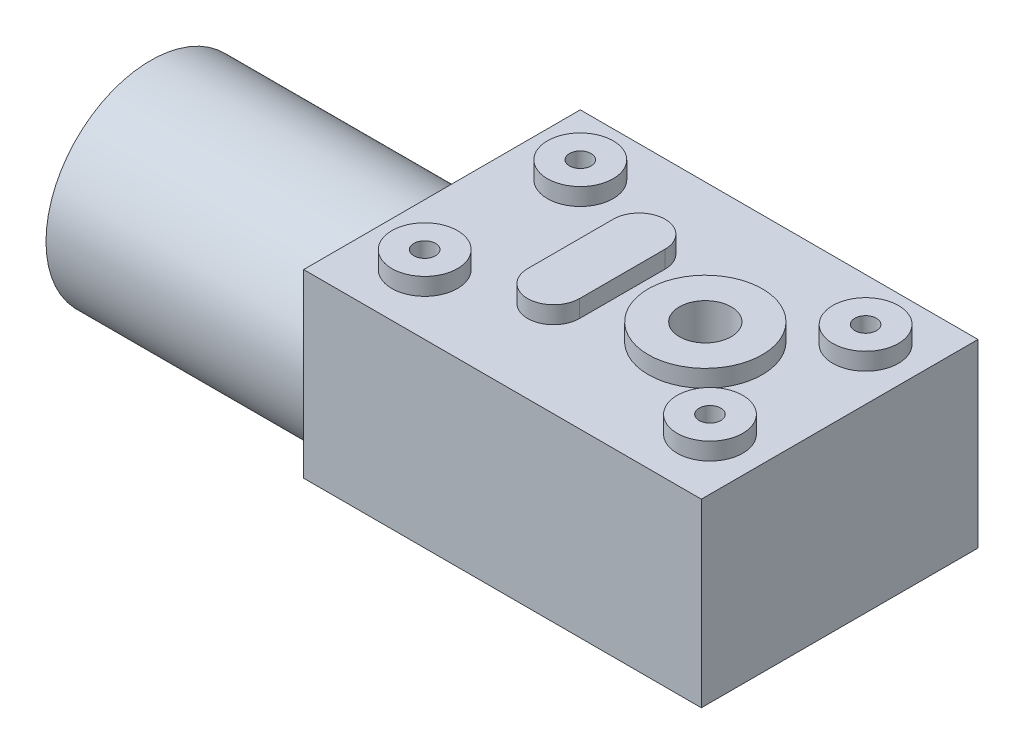
ISO-10303-21;
HEADER;
FILE_DESCRIPTION(('STEP AP214'),'2;1');
FILE_NAME('part.step','',(''),(''),'','','');
FILE_SCHEMA(('AUTOMOTIVE_DESIGN { 1 0 10303 214 1 1 1 1 }'));
ENDSEC;
DATA;
#1=APPLICATION_CONTEXT('core data for automotive mechanical design processes');
#2=APPLICATION_PROTOCOL_DEFINITION('international standard','automotive_design',2000,#1);
#3=PRODUCT_CONTEXT('',#1,'mechanical');
#4=PRODUCT('Part','Part','',(#3));
#5=PRODUCT_RELATED_PRODUCT_CATEGORY('part','',(#4));
#6=PRODUCT_DEFINITION_FORMATION('','',#4);
#7=PRODUCT_DEFINITION_CONTEXT('part definition',#1,'design');
#8=PRODUCT_DEFINITION('design','',#6,#7);
#9=PRODUCT_DEFINITION_SHAPE('','',#8);
#10=(LENGTH_UNIT() NAMED_UNIT(*) SI_UNIT(.MILLI.,.METRE.));
#11=(NAMED_UNIT(*) PLANE_ANGLE_UNIT() SI_UNIT($,.RADIAN.));
#12=(NAMED_UNIT(*) SI_UNIT($,.STERADIAN.) SOLID_ANGLE_UNIT());
#13=UNCERTAINTY_MEASURE_WITH_UNIT(LENGTH_MEASURE(1.E-05),#10,'distance_accuracy_value','');
#14=(GEOMETRIC_REPRESENTATION_CONTEXT(3) GLOBAL_UNCERTAINTY_ASSIGNED_CONTEXT((#13)) GLOBAL_UNIT_ASSIGNED_CONTEXT((#10,
#11,#12)) REPRESENTATION_CONTEXT('',''));
#15=CARTESIAN_POINT('',(0.,0.,0.));
#16=DIRECTION('',(0.,0.,1.));
#17=DIRECTION('',(1.,0.,0.));
#18=AXIS2_PLACEMENT_3D('',#15,#16,#17);
#19=CARTESIAN_POINT('',(0.,22.3,0.));
#20=DIRECTION('',(0.,1.,0.));
#21=DIRECTION('',(0.,0.,1.));
#22=AXIS2_PLACEMENT_3D('',#19,#20,#21);
#23=PLANE('',#22);
#24=CARTESIAN_POINT('',(-16.0000000000001,22.3,-9.));
#25=DIRECTION('',(0.,1.,0.));
#26=DIRECTION('',(0.,0.,1.));
#27=AXIS2_PLACEMENT_3D('',#24,#25,#26);
#28=CIRCLE('',#27,3.8);
#29=CARTESIAN_POINT('',(-16.0000000000001,22.3,-5.2));
#30=VERTEX_POINT('',#29);
#31=EDGE_CURVE('E211',#30,#30,#28,.T.);
#32=ORIENTED_EDGE('',*,*,#31,.F.);
#33=EDGE_LOOP('',(#32));
#34=FACE_BOUND('',#33,.T.);
#35=CARTESIAN_POINT('',(16.9999999999999,22.3,-9.));
#36=DIRECTION('',(0.,1.,0.));
#37=DIRECTION('',(0.,0.,1.));
#38=AXIS2_PLACEMENT_3D('',#35,#36,#37);
#39=CIRCLE('',#38,3.8);
#40=CARTESIAN_POINT('',(16.9999999999999,22.3,-5.2));
#41=VERTEX_POINT('',#40);
#42=EDGE_CURVE('E216',#41,#41,#39,.T.);
#43=ORIENTED_EDGE('',*,*,#42,.F.);
#44=EDGE_LOOP('',(#43));
#45=FACE_BOUND('',#44,.T.);
#46=CARTESIAN_POINT('',(17.,22.3,9.));
#47=DIRECTION('',(0.,1.,0.));
#48=DIRECTION('',(0.,0.,1.));
#49=AXIS2_PLACEMENT_3D('',#46,#47,#48);
#50=CIRCLE('',#49,3.8);
#51=CARTESIAN_POINT('',(17.,22.3,12.8));
#52=VERTEX_POINT('',#51);
#53=EDGE_CURVE('E224',#52,#52,#50,.T.);
#54=ORIENTED_EDGE('',*,*,#53,.F.);
#55=EDGE_LOOP('',(#54));
#56=FACE_BOUND('',#55,.T.);
#57=CARTESIAN_POINT('',(7.46062052505967,22.3,0.));
#58=DIRECTION('',(0.,1.,0.));
#59=DIRECTION('',(0.,0.,1.));
#60=AXIS2_PLACEMENT_3D('',#57,#58,#59);
#61=CIRCLE('',#60,6.6);
#62=CARTESIAN_POINT('',(7.46062052505967,22.3,6.6));
#63=VERTEX_POINT('',#62);
#64=EDGE_CURVE('E276',#63,#63,#61,.T.);
#65=ORIENTED_EDGE('',*,*,#64,.F.);
#66=EDGE_LOOP('',(#65));
#67=FACE_BOUND('',#66,.T.);
#68=CARTESIAN_POINT('',(-16.,22.3,9.));
#69=DIRECTION('',(0.,1.,0.));
#70=DIRECTION('',(0.,0.,1.));
#71=AXIS2_PLACEMENT_3D('',#68,#69,#70);
#72=CIRCLE('',#71,3.8);
#73=CARTESIAN_POINT('',(-16.,22.3,12.8));
#74=VERTEX_POINT('',#73);
#75=EDGE_CURVE('E281',#74,#74,#72,.T.);
#76=ORIENTED_EDGE('',*,*,#75,.F.);
#77=EDGE_LOOP('',(#76));
#78=FACE_BOUND('',#77,.T.);
#79=DIRECTION('',(1.,0.,0.));
#80=VECTOR('',#79,1.);
#81=CARTESIAN_POINT('',(0.,22.3,16.));
#82=LINE('',#81,#80);
#83=CARTESIAN_POINT('',(-23.,22.3,16.));
#84=VERTEX_POINT('',#83);
#85=CARTESIAN_POINT('',(23.,22.3,16.));
#86=VERTEX_POINT('',#85);
#87=EDGE_CURVE('E292',#84,#86,#82,.T.);
#88=ORIENTED_EDGE('',*,*,#87,.T.);
#89=DIRECTION('',(0.,0.,-1.));
#90=VECTOR('',#89,1.);
#91=CARTESIAN_POINT('',(23.,22.3,0.));
#92=LINE('',#91,#90);
#93=CARTESIAN_POINT('',(23.,22.3,-16.));
#94=VERTEX_POINT('',#93);
#95=EDGE_CURVE('E296',#86,#94,#92,.T.);
#96=ORIENTED_EDGE('',*,*,#95,.T.);
#97=DIRECTION('',(1.,0.,0.));
#98=VECTOR('',#97,1.);
#99=CARTESIAN_POINT('',(0.,22.3,-16.));
#100=LINE('',#99,#98);
#101=CARTESIAN_POINT('',(-23.,22.3,-16.));
#102=VERTEX_POINT('',#101);
#103=EDGE_CURVE('E300',#102,#94,#100,.T.);
#104=ORIENTED_EDGE('',*,*,#103,.F.);
#105=DIRECTION('',(0.,0.,-1.));
#106=VECTOR('',#105,1.);
#107=CARTESIAN_POINT('',(-23.,22.3,0.));
#108=LINE('',#107,#106);
#109=EDGE_CURVE('E304',#84,#102,#108,.T.);
#110=ORIENTED_EDGE('',*,*,#109,.F.);
#111=EDGE_LOOP('',(#88,#96,#104,#110));
#112=FACE_BOUND('',#111,.T.);
#113=DIRECTION('',(0.,0.,-1.));
#114=VECTOR('',#113,1.);
#115=CARTESIAN_POINT('',(-2.13937947494033,22.3,4.95));
#116=LINE('',#115,#114);
#117=CARTESIAN_POINT('',(-2.13937947494033,22.3,4.95));
#118=VERTEX_POINT('',#117);
#119=CARTESIAN_POINT('',(-2.13937947494033,22.3,-4.95));
#120=VERTEX_POINT('',#119);
#121=EDGE_CURVE('E254',#118,#120,#116,.T.);
#122=ORIENTED_EDGE('',*,*,#121,.F.);
#123=CARTESIAN_POINT('',(-5.13937947494033,22.3,4.95));
#124=DIRECTION('',(0.,1.,0.));
#125=DIRECTION('',(0.,0.,1.));
#126=AXIS2_PLACEMENT_3D('',#123,#124,#125);
#127=CIRCLE('',#126,3.);
#128=CARTESIAN_POINT('',(-8.13937947494033,22.3,4.95));
#129=VERTEX_POINT('',#128);
#130=EDGE_CURVE('E232',#129,#118,#127,.T.);
#131=ORIENTED_EDGE('',*,*,#130,.F.);
#132=DIRECTION('',(0.,0.,1.));
#133=VECTOR('',#132,1.);
#134=CARTESIAN_POINT('',(-8.13937947494033,22.3,4.95));
#135=LINE('',#134,#133);
#136=CARTESIAN_POINT('',(-8.13937947494033,22.3,-4.95));
#137=VERTEX_POINT('',#136);
#138=EDGE_CURVE('E241',#137,#129,#135,.T.);
#139=ORIENTED_EDGE('',*,*,#138,.F.);
#140=CARTESIAN_POINT('',(-5.13937947494033,22.3,-4.95));
#141=DIRECTION('',(0.,1.,0.));
#142=DIRECTION('',(0.,0.,1.));
#143=AXIS2_PLACEMENT_3D('',#140,#141,#142);
#144=CIRCLE('',#143,3.);
#145=EDGE_CURVE('E257',#120,#137,#144,.T.);
#146=ORIENTED_EDGE('',*,*,#145,.F.);
#147=EDGE_LOOP('',(#122,#131,#139,#146));
#148=FACE_BOUND('',#147,.T.);
#149=ADVANCED_FACE('F42',(#34,#45,#56,#67,#78,#112,#148),#23,.T.);
#150=CARTESIAN_POINT('',(0.,22.3,16.));
#151=DIRECTION('',(0.,0.,-1.));
#152=DIRECTION('',(-1.,0.,0.));
#153=AXIS2_PLACEMENT_3D('',#150,#151,#152);
#154=PLANE('',#153);
#155=DIRECTION('',(0.,-1.,0.));
#156=VECTOR('',#155,1.);
#157=CARTESIAN_POINT('',(-23.,22.3,16.));
#158=LINE('',#157,#156);
#159=CARTESIAN_POINT('',(-23.,1.4,16.));
#160=VERTEX_POINT('',#159);
#161=EDGE_CURVE('E308',#84,#160,#158,.T.);
#162=ORIENTED_EDGE('',*,*,#161,.T.);
#163=DIRECTION('',(1.,0.,0.));
#164=VECTOR('',#163,1.);
#165=CARTESIAN_POINT('',(0.,1.4,16.));
#166=LINE('',#165,#164);
#167=CARTESIAN_POINT('',(23.,1.4,16.));
#168=VERTEX_POINT('',#167);
#169=EDGE_CURVE('E327',#160,#168,#166,.T.);
#170=ORIENTED_EDGE('',*,*,#169,.T.);
#171=DIRECTION('',(0.,-1.,0.));
#172=VECTOR('',#171,1.);
#173=CARTESIAN_POINT('',(23.,22.3,16.));
#174=LINE('',#173,#172);
#175=EDGE_CURVE('E324',#86,#168,#174,.T.);
#176=ORIENTED_EDGE('',*,*,#175,.F.);
#177=ORIENTED_EDGE('',*,*,#87,.F.);
#178=EDGE_LOOP('',(#162,#170,#176,#177));
#179=FACE_BOUND('',#178,.T.);
#180=ADVANCED_FACE('F412',(#179),#154,.F.);
#181=CARTESIAN_POINT('',(23.,22.3,0.));
#182=DIRECTION('',(-1.,0.,0.));
#183=DIRECTION('',(0.,0.,1.));
#184=AXIS2_PLACEMENT_3D('',#181,#182,#183);
#185=PLANE('',#184);
#186=ORIENTED_EDGE('',*,*,#175,.T.);
#187=DIRECTION('',(0.,0.,-1.));
#188=VECTOR('',#187,1.);
#189=CARTESIAN_POINT('',(23.,1.4,0.));
#190=LINE('',#189,#188);
#191=CARTESIAN_POINT('',(23.,1.4,-16.));
#192=VERTEX_POINT('',#191);
#193=EDGE_CURVE('E52',#168,#192,#190,.T.);
#194=ORIENTED_EDGE('',*,*,#193,.T.);
#195=DIRECTION('',(0.,-1.,0.));
#196=VECTOR('',#195,1.);
#197=CARTESIAN_POINT('',(23.,22.3,-16.));
#198=LINE('',#197,#196);
#199=EDGE_CURVE('E321',#94,#192,#198,.T.);
#200=ORIENTED_EDGE('',*,*,#199,.F.);
#201=ORIENTED_EDGE('',*,*,#95,.F.);
#202=EDGE_LOOP('',(#186,#194,#200,#201));
#203=FACE_BOUND('',#202,.T.);
#204=ADVANCED_FACE('F418',(#203),#185,.F.);
#205=CARTESIAN_POINT('',(0.,22.3,-16.));
#206=DIRECTION('',(0.,0.,-1.));
#207=DIRECTION('',(-1.,0.,0.));
#208=AXIS2_PLACEMENT_3D('',#205,#206,#207);
#209=PLANE('',#208);
#210=ORIENTED_EDGE('',*,*,#199,.T.);
#211=DIRECTION('',(-1.,0.,0.));
#212=VECTOR('',#211,1.);
#213=CARTESIAN_POINT('',(-23.,1.4,-16.));
#214=LINE('',#213,#212);
#215=CARTESIAN_POINT('',(-23.,1.4,-16.));
#216=VERTEX_POINT('',#215);
#217=EDGE_CURVE('E11',#192,#216,#214,.T.);
#218=ORIENTED_EDGE('',*,*,#217,.T.);
#219=DIRECTION('',(0.,-1.,0.));
#220=VECTOR('',#219,1.);
#221=CARTESIAN_POINT('',(-23.,22.3,-16.));
#222=LINE('',#221,#220);
#223=EDGE_CURVE('E318',#102,#216,#222,.T.);
#224=ORIENTED_EDGE('',*,*,#223,.F.);
#225=ORIENTED_EDGE('',*,*,#103,.T.);
#226=EDGE_LOOP('',(#210,#218,#224,#225));
#227=FACE_BOUND('',#226,.T.);
#228=ADVANCED_FACE('F435',(#227),#209,.T.);
#229=CARTESIAN_POINT('',(-23.,22.3,0.));
#230=DIRECTION('',(-1.,0.,0.));
#231=DIRECTION('',(0.,0.,1.));
#232=AXIS2_PLACEMENT_3D('',#229,#230,#231);
#233=PLANE('',#232);
#234=DIRECTION('',(0.,0.,-1.));
#235=VECTOR('',#234,1.);
#236=CARTESIAN_POINT('',(-23.,0.,0.));
#237=LINE('',#236,#235);
#238=CARTESIAN_POINT('',(-23.,0.,10.7751288694036));
#239=VERTEX_POINT('',#238);
#240=CARTESIAN_POINT('',(-23.,0.,10.7593892892514));
#241=VERTEX_POINT('',#240);
#242=EDGE_CURVE('E309',#239,#241,#237,.T.);
#243=ORIENTED_EDGE('',*,*,#242,.F.);
#244=DIRECTION('',(0.,-0.25881904510252,-0.965925826289069));
#245=VECTOR('',#244,1.);
#246=CARTESIAN_POINT('',(-23.,-1.19996546954738,6.29679676972447));
#247=LINE('',#246,#245);
#248=EDGE_CURVE('E342',#239,#160,#247,.F.);
#249=ORIENTED_EDGE('',*,*,#248,.T.);
#250=ORIENTED_EDGE('',*,*,#161,.F.);
#251=ORIENTED_EDGE('',*,*,#109,.T.);
#252=ORIENTED_EDGE('',*,*,#223,.T.);
#253=DIRECTION('',(0.,-0.25881904510252,0.965925826289069));
#254=VECTOR('',#253,1.);
#255=CARTESIAN_POINT('',(-23.,-1.19996546954738,-6.29679676972447));
#256=LINE('',#255,#254);
#257=CARTESIAN_POINT('',(-23.,0.,-10.7751288694036));
#258=VERTEX_POINT('',#257);
#259=EDGE_CURVE('E340',#216,#258,#256,.T.);
#260=ORIENTED_EDGE('',*,*,#259,.T.);
#261=CARTESIAN_POINT('',(-23.,0.,-4.95938928925142));
#262=VERTEX_POINT('',#261);
#263=EDGE_CURVE('E288',#262,#258,#237,.T.);
#264=ORIENTED_EDGE('',*,*,#263,.F.);
#265=CARTESIAN_POINT('',(-23.,9.2,2.9));
#266=DIRECTION('',(-1.,0.,0.));
#267=DIRECTION('',(0.,0.,1.));
#268=AXIS2_PLACEMENT_3D('',#265,#266,#267);
#269=CIRCLE('',#268,12.1);
#270=EDGE_CURVE('E207',#241,#262,#269,.T.);
#271=ORIENTED_EDGE('',*,*,#270,.F.);
#272=EDGE_LOOP('',(#243,#249,#250,#251,#252,#260,#264,#271));
#273=FACE_BOUND('',#272,.T.);
#274=ADVANCED_FACE('F363',(#273),#233,.T.);
#275=CARTESIAN_POINT('',(7.46062052505967,22.3,0.));
#276=DIRECTION('',(0.,-1.,0.));
#277=DIRECTION('',(0.,0.,-1.));
#278=AXIS2_PLACEMENT_3D('',#275,#276,#277);
#279=CYLINDRICAL_SURFACE('',#278,3.);
#280=CARTESIAN_POINT('',(7.46062052505967,0.,0.));
#281=DIRECTION('',(0.,1.,0.));
#282=DIRECTION('',(0.,0.,1.));
#283=AXIS2_PLACEMENT_3D('',#280,#281,#282);
#284=CIRCLE('',#283,3.);
#285=CARTESIAN_POINT('',(7.46062052505967,0.,3.));
#286=VERTEX_POINT('',#285);
#287=EDGE_CURVE('E297',#286,#286,#284,.T.);
#288=ORIENTED_EDGE('',*,*,#287,.F.);
#289=EDGE_LOOP('',(#288));
#290=FACE_BOUND('',#289,.T.);
#291=CARTESIAN_POINT('',(7.46062052505967,24.3,0.));
#292=DIRECTION('',(0.,-1.,0.));
#293=DIRECTION('',(0.,0.,-1.));
#294=AXIS2_PLACEMENT_3D('',#291,#292,#293);
#295=CIRCLE('',#294,3.);
#296=CARTESIAN_POINT('',(7.46062052505967,24.3,-3.));
#297=VERTEX_POINT('',#296);
#298=EDGE_CURVE('E203',#297,#297,#295,.T.);
#299=ORIENTED_EDGE('',*,*,#298,.F.);
#300=EDGE_LOOP('',(#299));
#301=FACE_BOUND('',#300,.T.);
#302=ADVANCED_FACE('F429',(#290,#301),#279,.F.);
#303=CARTESIAN_POINT('',(0.,0.,0.));
#304=DIRECTION('',(0.,1.,0.));
#305=DIRECTION('',(0.,0.,1.));
#306=AXIS2_PLACEMENT_3D('',#303,#304,#305);
#307=PLANE('',#306);
#308=DIRECTION('',(0.,0.,1.));
#309=VECTOR('',#308,1.);
#310=CARTESIAN_POINT('',(17.7751288694036,0.,0.));
#311=LINE('',#310,#309);
#312=CARTESIAN_POINT('',(17.7751288694036,0.,-10.7751288694036));
#313=VERTEX_POINT('',#312);
#314=CARTESIAN_POINT('',(17.7751288694036,0.,10.7751288694036));
#315=VERTEX_POINT('',#314);
#316=EDGE_CURVE('E334',#313,#315,#311,.T.);
#317=ORIENTED_EDGE('',*,*,#316,.T.);
#318=DIRECTION('',(-1.,0.,0.));
#319=VECTOR('',#318,1.);
#320=CARTESIAN_POINT('',(0.,0.,10.7751288694036));
#321=LINE('',#320,#319);
#322=EDGE_CURVE('E337',#315,#239,#321,.T.);
#323=ORIENTED_EDGE('',*,*,#322,.T.);
#324=ORIENTED_EDGE('',*,*,#242,.T.);
#325=EDGE_CURVE('E311',#241,#262,#237,.T.);
#326=ORIENTED_EDGE('',*,*,#325,.T.);
#327=ORIENTED_EDGE('',*,*,#263,.T.);
#328=DIRECTION('',(1.,0.,0.));
#329=VECTOR('',#328,1.);
#330=CARTESIAN_POINT('',(23.,0.,-10.7751288694036));
#331=LINE('',#330,#329);
#332=EDGE_CURVE('E331',#258,#313,#331,.T.);
#333=ORIENTED_EDGE('',*,*,#332,.T.);
#334=EDGE_LOOP('',(#317,#323,#324,#326,#327,#333));
#335=FACE_BOUND('',#334,.T.);
#336=ORIENTED_EDGE('',*,*,#287,.T.);
#337=EDGE_LOOP('',(#336));
#338=FACE_BOUND('',#337,.T.);
#339=ADVANCED_FACE('F367',(#335,#338),#307,.F.);
#340=CARTESIAN_POINT('',(-16.,24.3,9.));
#341=DIRECTION('',(0.,-1.,0.));
#342=DIRECTION('',(0.,0.,-1.));
#343=AXIS2_PLACEMENT_3D('',#340,#341,#342);
#344=CYLINDRICAL_SURFACE('',#343,3.8);
#345=CARTESIAN_POINT('',(-16.,24.3,9.));
#346=DIRECTION('',(0.,1.,0.));
#347=DIRECTION('',(0.,0.,1.));
#348=AXIS2_PLACEMENT_3D('',#345,#346,#347);
#349=CIRCLE('',#348,3.8);
#350=CARTESIAN_POINT('',(-16.,24.3,12.8));
#351=VERTEX_POINT('',#350);
#352=EDGE_CURVE('E285',#351,#351,#349,.T.);
#353=ORIENTED_EDGE('',*,*,#352,.F.);
#354=EDGE_LOOP('',(#353));
#355=FACE_BOUND('',#354,.T.);
#356=ORIENTED_EDGE('',*,*,#75,.T.);
#357=EDGE_LOOP('',(#356));
#358=FACE_BOUND('',#357,.T.);
#359=ADVANCED_FACE('F425',(#355,#358),#344,.T.);
#360=CARTESIAN_POINT('',(-16.,24.3,9.));
#361=DIRECTION('',(0.,1.,0.));
#362=DIRECTION('',(0.,0.,1.));
#363=AXIS2_PLACEMENT_3D('',#360,#361,#362);
#364=PLANE('',#363);
#365=CARTESIAN_POINT('',(-16.,24.3,9.));
#366=DIRECTION('',(0.,1.,0.));
#367=DIRECTION('',(0.,0.,1.));
#368=AXIS2_PLACEMENT_3D('',#365,#366,#367);
#369=CIRCLE('',#368,1.25);
#370=CARTESIAN_POINT('',(-16.,24.3,10.25));
#371=VERTEX_POINT('',#370);
#372=EDGE_CURVE('E166',#371,#371,#369,.T.);
#373=ORIENTED_EDGE('',*,*,#372,.F.);
#374=EDGE_LOOP('',(#373));
#375=FACE_BOUND('',#374,.T.);
#376=ORIENTED_EDGE('',*,*,#352,.T.);
#377=EDGE_LOOP('',(#376));
#378=FACE_BOUND('',#377,.T.);
#379=ADVANCED_FACE('F516',(#375,#378),#364,.T.);
#380=CARTESIAN_POINT('',(7.46062052505967,24.3,0.));
#381=DIRECTION('',(0.,1.,0.));
#382=DIRECTION('',(0.,0.,1.));
#383=AXIS2_PLACEMENT_3D('',#380,#381,#382);
#384=PLANE('',#383);
#385=ORIENTED_EDGE('',*,*,#298,.T.);
#386=EDGE_LOOP('',(#385));
#387=FACE_BOUND('',#386,.T.);
#388=CARTESIAN_POINT('',(7.46062052505967,24.3,0.));
#389=DIRECTION('',(0.,1.,0.));
#390=DIRECTION('',(0.,0.,1.));
#391=AXIS2_PLACEMENT_3D('',#388,#389,#390);
#392=CIRCLE('',#391,6.6);
#393=CARTESIAN_POINT('',(7.46062052505967,24.3,6.6));
#394=VERTEX_POINT('',#393);
#395=EDGE_CURVE('E277',#394,#394,#392,.T.);
#396=ORIENTED_EDGE('',*,*,#395,.T.);
#397=EDGE_LOOP('',(#396));
#398=FACE_BOUND('',#397,.T.);
#399=ADVANCED_FACE('F513',(#387,#398),#384,.T.);
#400=CARTESIAN_POINT('',(7.46062052505967,24.3,0.));
#401=DIRECTION('',(0.,-1.,0.));
#402=DIRECTION('',(0.,0.,-1.));
#403=AXIS2_PLACEMENT_3D('',#400,#401,#402);
#404=CYLINDRICAL_SURFACE('',#403,6.6);
#405=ORIENTED_EDGE('',*,*,#395,.F.);
#406=EDGE_LOOP('',(#405));
#407=FACE_BOUND('',#406,.T.);
#408=ORIENTED_EDGE('',*,*,#64,.T.);
#409=EDGE_LOOP('',(#408));
#410=FACE_BOUND('',#409,.T.);
#411=ADVANCED_FACE('F511',(#407,#410),#404,.T.);
#412=CARTESIAN_POINT('',(-5.13937947494033,24.3,4.95));
#413=DIRECTION('',(0.,-1.,0.));
#414=DIRECTION('',(0.,0.,-1.));
#415=AXIS2_PLACEMENT_3D('',#412,#413,#414);
#416=CYLINDRICAL_SURFACE('',#415,3.);
#417=ORIENTED_EDGE('',*,*,#130,.T.);
#418=DIRECTION('',(0.,-1.,0.));
#419=VECTOR('',#418,1.);
#420=CARTESIAN_POINT('',(-2.13937947494033,24.3,4.95));
#421=LINE('',#420,#419);
#422=CARTESIAN_POINT('',(-2.13937947494033,24.3,4.95));
#423=VERTEX_POINT('',#422);
#424=EDGE_CURVE('E273',#423,#118,#421,.T.);
#425=ORIENTED_EDGE('',*,*,#424,.F.);
#426=CARTESIAN_POINT('',(-5.13937947494033,24.3,4.95));
#427=DIRECTION('',(0.,1.,0.));
#428=DIRECTION('',(0.,0.,1.));
#429=AXIS2_PLACEMENT_3D('',#426,#427,#428);
#430=CIRCLE('',#429,3.);
#431=CARTESIAN_POINT('',(-8.13937947494033,24.3,4.95));
#432=VERTEX_POINT('',#431);
#433=EDGE_CURVE('E236',#432,#423,#430,.T.);
#434=ORIENTED_EDGE('',*,*,#433,.F.);
#435=DIRECTION('',(0.,-1.,0.));
#436=VECTOR('',#435,1.);
#437=CARTESIAN_POINT('',(-8.13937947494033,24.3,4.95));
#438=LINE('',#437,#436);
#439=EDGE_CURVE('E250',#432,#129,#438,.T.);
#440=ORIENTED_EDGE('',*,*,#439,.T.);
#441=EDGE_LOOP('',(#417,#425,#434,#440));
#442=FACE_BOUND('',#441,.T.);
#443=ADVANCED_FACE('F507',(#442),#416,.T.);
#444=CARTESIAN_POINT('',(-2.13937947494033,24.3,4.95));
#445=DIRECTION('',(-1.,0.,0.));
#446=DIRECTION('',(0.,0.,1.));
#447=AXIS2_PLACEMENT_3D('',#444,#445,#446);
#448=PLANE('',#447);
#449=ORIENTED_EDGE('',*,*,#121,.T.);
#450=DIRECTION('',(0.,-1.,0.));
#451=VECTOR('',#450,1.);
#452=CARTESIAN_POINT('',(-2.13937947494033,24.3,-4.95));
#453=LINE('',#452,#451);
#454=CARTESIAN_POINT('',(-2.13937947494033,24.3,-4.95));
#455=VERTEX_POINT('',#454);
#456=EDGE_CURVE('E269',#455,#120,#453,.T.);
#457=ORIENTED_EDGE('',*,*,#456,.F.);
#458=DIRECTION('',(0.,0.,-1.));
#459=VECTOR('',#458,1.);
#460=CARTESIAN_POINT('',(-2.13937947494033,24.3,4.95));
#461=LINE('',#460,#459);
#462=EDGE_CURVE('E240',#423,#455,#461,.T.);
#463=ORIENTED_EDGE('',*,*,#462,.F.);
#464=ORIENTED_EDGE('',*,*,#424,.T.);
#465=EDGE_LOOP('',(#449,#457,#463,#464));
#466=FACE_BOUND('',#465,.T.);
#467=ADVANCED_FACE('F503',(#466),#448,.F.);
#468=CARTESIAN_POINT('',(-5.13937947494033,24.3,-4.95));
#469=DIRECTION('',(0.,-1.,0.));
#470=DIRECTION('',(0.,0.,-1.));
#471=AXIS2_PLACEMENT_3D('',#468,#469,#470);
#472=CYLINDRICAL_SURFACE('',#471,3.);
#473=ORIENTED_EDGE('',*,*,#145,.T.);
#474=DIRECTION('',(0.,-1.,0.));
#475=VECTOR('',#474,1.);
#476=CARTESIAN_POINT('',(-8.13937947494033,24.3,-4.95));
#477=LINE('',#476,#475);
#478=CARTESIAN_POINT('',(-8.13937947494033,24.3,-4.95));
#479=VERTEX_POINT('',#478);
#480=EDGE_CURVE('E266',#479,#137,#477,.T.);
#481=ORIENTED_EDGE('',*,*,#480,.F.);
#482=CARTESIAN_POINT('',(-5.13937947494033,24.3,-4.95));
#483=DIRECTION('',(0.,1.,0.));
#484=DIRECTION('',(0.,0.,1.));
#485=AXIS2_PLACEMENT_3D('',#482,#483,#484);
#486=CIRCLE('',#485,3.);
#487=EDGE_CURVE('E244',#455,#479,#486,.T.);
#488=ORIENTED_EDGE('',*,*,#487,.F.);
#489=ORIENTED_EDGE('',*,*,#456,.T.);
#490=EDGE_LOOP('',(#473,#481,#488,#489));
#491=FACE_BOUND('',#490,.T.);
#492=ADVANCED_FACE('F499',(#491),#472,.T.);
#493=CARTESIAN_POINT('',(-8.13937947494033,24.3,4.95));
#494=DIRECTION('',(1.,0.,0.));
#495=DIRECTION('',(0.,0.,-1.));
#496=AXIS2_PLACEMENT_3D('',#493,#494,#495);
#497=PLANE('',#496);
#498=ORIENTED_EDGE('',*,*,#138,.T.);
#499=ORIENTED_EDGE('',*,*,#439,.F.);
#500=DIRECTION('',(0.,0.,1.));
#501=VECTOR('',#500,1.);
#502=CARTESIAN_POINT('',(-8.13937947494033,24.3,4.95));
#503=LINE('',#502,#501);
#504=EDGE_CURVE('E247',#479,#432,#503,.T.);
#505=ORIENTED_EDGE('',*,*,#504,.F.);
#506=ORIENTED_EDGE('',*,*,#480,.T.);
#507=EDGE_LOOP('',(#498,#499,#505,#506));
#508=FACE_BOUND('',#507,.T.);
#509=ADVANCED_FACE('F495',(#508),#497,.F.);
#510=CARTESIAN_POINT('',(-5.13937947494033,24.3,4.95));
#511=DIRECTION('',(0.,1.,0.));
#512=DIRECTION('',(0.,0.,1.));
#513=AXIS2_PLACEMENT_3D('',#510,#511,#512);
#514=PLANE('',#513);
#515=ORIENTED_EDGE('',*,*,#433,.T.);
#516=ORIENTED_EDGE('',*,*,#462,.T.);
#517=ORIENTED_EDGE('',*,*,#487,.T.);
#518=ORIENTED_EDGE('',*,*,#504,.T.);
#519=EDGE_LOOP('',(#515,#516,#517,#518));
#520=FACE_BOUND('',#519,.T.);
#521=ADVANCED_FACE('F491',(#520),#514,.T.);
#522=CARTESIAN_POINT('',(17.,24.3,9.));
#523=DIRECTION('',(0.,-1.,0.));
#524=DIRECTION('',(0.,0.,-1.));
#525=AXIS2_PLACEMENT_3D('',#522,#523,#524);
#526=CYLINDRICAL_SURFACE('',#525,3.8);
#527=CARTESIAN_POINT('',(17.,24.3,9.));
#528=DIRECTION('',(0.,1.,0.));
#529=DIRECTION('',(0.,0.,1.));
#530=AXIS2_PLACEMENT_3D('',#527,#528,#529);
#531=CIRCLE('',#530,3.8);
#532=CARTESIAN_POINT('',(17.,24.3,12.8));
#533=VERTEX_POINT('',#532);
#534=EDGE_CURVE('E228',#533,#533,#531,.T.);
#535=ORIENTED_EDGE('',*,*,#534,.F.);
#536=EDGE_LOOP('',(#535));
#537=FACE_BOUND('',#536,.T.);
#538=ORIENTED_EDGE('',*,*,#53,.T.);
#539=EDGE_LOOP('',(#538));
#540=FACE_BOUND('',#539,.T.);
#541=ADVANCED_FACE('F487',(#537,#540),#526,.T.);
#542=CARTESIAN_POINT('',(17.,24.3,9.));
#543=DIRECTION('',(0.,1.,0.));
#544=DIRECTION('',(0.,0.,1.));
#545=AXIS2_PLACEMENT_3D('',#542,#543,#544);
#546=PLANE('',#545);
#547=CARTESIAN_POINT('',(17.,24.3,9.));
#548=DIRECTION('',(0.,1.,0.));
#549=DIRECTION('',(0.,0.,1.));
#550=AXIS2_PLACEMENT_3D('',#547,#548,#549);
#551=CIRCLE('',#550,1.25);
#552=CARTESIAN_POINT('',(17.,24.3,10.25));
#553=VERTEX_POINT('',#552);
#554=EDGE_CURVE('E190',#553,#553,#551,.T.);
#555=ORIENTED_EDGE('',*,*,#554,.F.);
#556=EDGE_LOOP('',(#555));
#557=FACE_BOUND('',#556,.T.);
#558=ORIENTED_EDGE('',*,*,#534,.T.);
#559=EDGE_LOOP('',(#558));
#560=FACE_BOUND('',#559,.T.);
#561=ADVANCED_FACE('F483',(#557,#560),#546,.T.);
#562=CARTESIAN_POINT('',(16.9999999999999,24.3,-9.));
#563=DIRECTION('',(0.,-1.,0.));
#564=DIRECTION('',(0.,0.,-1.));
#565=AXIS2_PLACEMENT_3D('',#562,#563,#564);
#566=CYLINDRICAL_SURFACE('',#565,3.8);
#567=CARTESIAN_POINT('',(16.9999999999999,24.3,-9.));
#568=DIRECTION('',(0.,1.,0.));
#569=DIRECTION('',(0.,0.,1.));
#570=AXIS2_PLACEMENT_3D('',#567,#568,#569);
#571=CIRCLE('',#570,3.8);
#572=CARTESIAN_POINT('',(16.9999999999999,24.3,-5.2));
#573=VERTEX_POINT('',#572);
#574=EDGE_CURVE('E220',#573,#573,#571,.T.);
#575=ORIENTED_EDGE('',*,*,#574,.F.);
#576=EDGE_LOOP('',(#575));
#577=FACE_BOUND('',#576,.T.);
#578=ORIENTED_EDGE('',*,*,#42,.T.);
#579=EDGE_LOOP('',(#578));
#580=FACE_BOUND('',#579,.T.);
#581=ADVANCED_FACE('F479',(#577,#580),#566,.T.);
#582=CARTESIAN_POINT('',(16.9999999999999,24.3,-9.));
#583=DIRECTION('',(0.,1.,0.));
#584=DIRECTION('',(0.,0.,1.));
#585=AXIS2_PLACEMENT_3D('',#582,#583,#584);
#586=PLANE('',#585);
#587=CARTESIAN_POINT('',(16.9999999999999,24.3,-9.));
#588=DIRECTION('',(0.,1.,0.));
#589=DIRECTION('',(0.,0.,1.));
#590=AXIS2_PLACEMENT_3D('',#587,#588,#589);
#591=CIRCLE('',#590,1.25);
#592=CARTESIAN_POINT('',(16.9999999999999,24.3,-7.75));
#593=VERTEX_POINT('',#592);
#594=EDGE_CURVE('E182',#593,#593,#591,.T.);
#595=ORIENTED_EDGE('',*,*,#594,.F.);
#596=EDGE_LOOP('',(#595));
#597=FACE_BOUND('',#596,.T.);
#598=ORIENTED_EDGE('',*,*,#574,.T.);
#599=EDGE_LOOP('',(#598));
#600=FACE_BOUND('',#599,.T.);
#601=ADVANCED_FACE('F475',(#597,#600),#586,.T.);
#602=CARTESIAN_POINT('',(-16.0000000000001,24.3,-9.));
#603=DIRECTION('',(0.,-1.,0.));
#604=DIRECTION('',(0.,0.,-1.));
#605=AXIS2_PLACEMENT_3D('',#602,#603,#604);
#606=CYLINDRICAL_SURFACE('',#605,3.8);
#607=CARTESIAN_POINT('',(-16.0000000000001,24.3,-9.));
#608=DIRECTION('',(0.,1.,0.));
#609=DIRECTION('',(0.,0.,1.));
#610=AXIS2_PLACEMENT_3D('',#607,#608,#609);
#611=CIRCLE('',#610,3.8);
#612=CARTESIAN_POINT('',(-16.0000000000001,24.3,-5.2));
#613=VERTEX_POINT('',#612);
#614=EDGE_CURVE('E212',#613,#613,#611,.T.);
#615=ORIENTED_EDGE('',*,*,#614,.F.);
#616=EDGE_LOOP('',(#615));
#617=FACE_BOUND('',#616,.T.);
#618=ORIENTED_EDGE('',*,*,#31,.T.);
#619=EDGE_LOOP('',(#618));
#620=FACE_BOUND('',#619,.T.);
#621=ADVANCED_FACE('F471',(#617,#620),#606,.T.);
#622=CARTESIAN_POINT('',(-16.0000000000001,24.3,-9.));
#623=DIRECTION('',(0.,1.,0.));
#624=DIRECTION('',(0.,0.,1.));
#625=AXIS2_PLACEMENT_3D('',#622,#623,#624);
#626=PLANE('',#625);
#627=CARTESIAN_POINT('',(-16.0000000000001,24.3,-9.));
#628=DIRECTION('',(0.,1.,0.));
#629=DIRECTION('',(0.,0.,1.));
#630=AXIS2_PLACEMENT_3D('',#627,#628,#629);
#631=CIRCLE('',#630,1.25);
#632=CARTESIAN_POINT('',(-16.0000000000001,24.3,-7.75));
#633=VERTEX_POINT('',#632);
#634=EDGE_CURVE('E165',#633,#633,#631,.T.);
#635=ORIENTED_EDGE('',*,*,#634,.F.);
#636=EDGE_LOOP('',(#635));
#637=FACE_BOUND('',#636,.T.);
#638=ORIENTED_EDGE('',*,*,#614,.T.);
#639=EDGE_LOOP('',(#638));
#640=FACE_BOUND('',#639,.T.);
#641=ADVANCED_FACE('F467',(#637,#640),#626,.T.);
#642=CARTESIAN_POINT('',(-53.8,9.2,2.9));
#643=DIRECTION('',(1.,0.,0.));
#644=DIRECTION('',(0.,0.,-1.));
#645=AXIS2_PLACEMENT_3D('',#642,#643,#644);
#646=CYLINDRICAL_SURFACE('',#645,12.1);
#647=CARTESIAN_POINT('',(-53.8,9.2,2.9));
#648=DIRECTION('',(-1.,0.,0.));
#649=DIRECTION('',(0.,0.,1.));
#650=AXIS2_PLACEMENT_3D('',#647,#648,#649);
#651=CIRCLE('',#650,12.1);
#652=CARTESIAN_POINT('',(-53.8,9.2,15.));
#653=VERTEX_POINT('',#652);
#654=EDGE_CURVE('E199',#653,#653,#651,.T.);
#655=ORIENTED_EDGE('',*,*,#654,.F.);
#656=EDGE_LOOP('',(#655));
#657=FACE_BOUND('',#656,.T.);
#658=EDGE_CURVE('E204',#262,#241,#269,.T.);
#659=ORIENTED_EDGE('',*,*,#658,.T.);
#660=ORIENTED_EDGE('',*,*,#270,.T.);
#661=EDGE_LOOP('',(#659,#660));
#662=FACE_BOUND('',#661,.T.);
#663=ADVANCED_FACE('F374',(#657,#662),#646,.T.);
#664=CARTESIAN_POINT('',(-53.8,9.2,2.9));
#665=DIRECTION('',(-1.,0.,0.));
#666=DIRECTION('',(0.,0.,1.));
#667=AXIS2_PLACEMENT_3D('',#664,#665,#666);
#668=PLANE('',#667);
#669=CARTESIAN_POINT('',(-53.8,9.2,2.9));
#670=DIRECTION('',(-1.,0.,0.));
#671=DIRECTION('',(0.,0.,1.));
#672=AXIS2_PLACEMENT_3D('',#669,#670,#671);
#673=CIRCLE('',#672,11.8);
#674=CARTESIAN_POINT('',(-53.8,9.2,14.7));
#675=VERTEX_POINT('',#674);
#676=EDGE_CURVE('E377',#675,#675,#673,.T.);
#677=ORIENTED_EDGE('',*,*,#676,.F.);
#678=EDGE_LOOP('',(#677));
#679=FACE_BOUND('',#678,.T.);
#680=ORIENTED_EDGE('',*,*,#654,.T.);
#681=EDGE_LOOP('',(#680));
#682=FACE_BOUND('',#681,.T.);
#683=ADVANCED_FACE('F456',(#679,#682),#668,.T.);
#684=CARTESIAN_POINT('',(-23.,9.2,2.9));
#685=DIRECTION('',(-1.,0.,0.));
#686=DIRECTION('',(0.,0.,1.));
#687=AXIS2_PLACEMENT_3D('',#684,#685,#686);
#688=PLANE('',#687);
#689=ORIENTED_EDGE('',*,*,#325,.F.);
#690=ORIENTED_EDGE('',*,*,#658,.F.);
#691=EDGE_LOOP('',(#689,#690));
#692=FACE_BOUND('',#691,.T.);
#693=ADVANCED_FACE('F372',(#692),#688,.F.);
#694=CARTESIAN_POINT('',(0.,0.,-10.7751288694036));
#695=DIRECTION('',(0.,-0.965925826289069,-0.25881904510252));
#696=DIRECTION('',(-1.,0.,0.));
#697=AXIS2_PLACEMENT_3D('',#694,#695,#696);
#698=PLANE('',#697);
#699=ORIENTED_EDGE('',*,*,#259,.F.);
#700=ORIENTED_EDGE('',*,*,#217,.F.);
#701=DIRECTION('',(0.694746590606866,0.186156787897385,-0.694746590606866));
#702=VECTOR('',#701,1.);
#703=CARTESIAN_POINT('',(9.19555720042788,-2.29888930010696,-2.19555720042788));
#704=LINE('',#703,#702);
#705=EDGE_CURVE('E47',#313,#192,#704,.T.);
#706=ORIENTED_EDGE('',*,*,#705,.F.);
#707=ORIENTED_EDGE('',*,*,#332,.F.);
#708=EDGE_LOOP('',(#699,#700,#706,#707));
#709=FACE_BOUND('',#708,.T.);
#710=ADVANCED_FACE('F45',(#709),#698,.T.);
#711=CARTESIAN_POINT('',(23.,1.4,0.));
#712=DIRECTION('',(-0.25881904510252,0.965925826289069,0.));
#713=DIRECTION('',(0.,0.,-1.));
#714=AXIS2_PLACEMENT_3D('',#711,#712,#713);
#715=PLANE('',#714);
#716=ORIENTED_EDGE('',*,*,#705,.T.);
#717=ORIENTED_EDGE('',*,*,#193,.F.);
#718=DIRECTION('',(-0.694746590606866,-0.186156787897385,-0.694746590606866));
#719=VECTOR('',#718,1.);
#720=CARTESIAN_POINT('',(15.2772347974422,-0.669308699360539,8.27723479744218));
#721=LINE('',#720,#719);
#722=EDGE_CURVE('E198',#315,#168,#721,.F.);
#723=ORIENTED_EDGE('',*,*,#722,.F.);
#724=ORIENTED_EDGE('',*,*,#316,.F.);
#725=EDGE_LOOP('',(#716,#717,#723,#724));
#726=FACE_BOUND('',#725,.T.);
#727=ADVANCED_FACE('F355',(#726),#715,.F.);
#728=CARTESIAN_POINT('',(0.,1.4,16.));
#729=DIRECTION('',(0.,0.965925826289069,-0.25881904510252));
#730=DIRECTION('',(1.,0.,0.));
#731=AXIS2_PLACEMENT_3D('',#728,#729,#730);
#732=PLANE('',#731);
#733=ORIENTED_EDGE('',*,*,#248,.F.);
#734=ORIENTED_EDGE('',*,*,#322,.F.);
#735=ORIENTED_EDGE('',*,*,#722,.T.);
#736=ORIENTED_EDGE('',*,*,#169,.F.);
#737=EDGE_LOOP('',(#733,#734,#735,#736));
#738=FACE_BOUND('',#737,.T.);
#739=ADVANCED_FACE('F441',(#738),#732,.F.);
#740=CARTESIAN_POINT('',(17.,21.7,9.));
#741=DIRECTION('',(0.,1.,0.));
#742=DIRECTION('',(0.,0.,1.));
#743=AXIS2_PLACEMENT_3D('',#740,#741,#742);
#744=CONICAL_SURFACE('',#743,1.25,1.02974425867666);
#745=CARTESIAN_POINT('',(17.,20.9489242262155,9.));
#746=VERTEX_POINT('',#745);
#747=VERTEX_LOOP('',#746);
#748=FACE_BOUND('',#747,.T.);
#749=CARTESIAN_POINT('',(17.,21.7,9.));
#750=DIRECTION('',(0.,1.,0.));
#751=DIRECTION('',(0.,0.,1.));
#752=AXIS2_PLACEMENT_3D('',#749,#750,#751);
#753=CIRCLE('',#752,1.25);
#754=CARTESIAN_POINT('',(17.,21.7,10.25));
#755=VERTEX_POINT('',#754);
#756=EDGE_CURVE('E194',#755,#755,#753,.T.);
#757=ORIENTED_EDGE('',*,*,#756,.T.);
#758=EDGE_LOOP('',(#757));
#759=FACE_BOUND('',#758,.T.);
#760=ADVANCED_FACE('F446',(#748,#759),#744,.F.);
#761=CARTESIAN_POINT('',(17.,24.3,9.));
#762=DIRECTION('',(0.,1.,0.));
#763=DIRECTION('',(0.,0.,1.));
#764=AXIS2_PLACEMENT_3D('',#761,#762,#763);
#765=CYLINDRICAL_SURFACE('',#764,1.25);
#766=ORIENTED_EDGE('',*,*,#756,.F.);
#767=EDGE_LOOP('',(#766));
#768=FACE_BOUND('',#767,.T.);
#769=ORIENTED_EDGE('',*,*,#554,.T.);
#770=EDGE_LOOP('',(#769));
#771=FACE_BOUND('',#770,.T.);
#772=ADVANCED_FACE('F570',(#768,#771),#765,.F.);
#773=CARTESIAN_POINT('',(16.9999999999999,21.7,-9.));
#774=DIRECTION('',(0.,1.,0.));
#775=DIRECTION('',(0.,0.,1.));
#776=AXIS2_PLACEMENT_3D('',#773,#774,#775);
#777=CONICAL_SURFACE('',#776,1.25,1.02974425867666);
#778=CARTESIAN_POINT('',(16.9999999999999,20.9489242262155,-9.));
#779=VERTEX_POINT('',#778);
#780=VERTEX_LOOP('',#779);
#781=FACE_BOUND('',#780,.T.);
#782=CARTESIAN_POINT('',(16.9999999999999,21.7,-9.));
#783=DIRECTION('',(0.,1.,0.));
#784=DIRECTION('',(0.,0.,1.));
#785=AXIS2_PLACEMENT_3D('',#782,#783,#784);
#786=CIRCLE('',#785,1.25);
#787=CARTESIAN_POINT('',(16.9999999999999,21.7,-7.75));
#788=VERTEX_POINT('',#787);
#789=EDGE_CURVE('E186',#788,#788,#786,.T.);
#790=ORIENTED_EDGE('',*,*,#789,.T.);
#791=EDGE_LOOP('',(#790));
#792=FACE_BOUND('',#791,.T.);
#793=ADVANCED_FACE('F566',(#781,#792),#777,.F.);
#794=CARTESIAN_POINT('',(16.9999999999999,24.3,-9.));
#795=DIRECTION('',(0.,1.,0.));
#796=DIRECTION('',(0.,0.,1.));
#797=AXIS2_PLACEMENT_3D('',#794,#795,#796);
#798=CYLINDRICAL_SURFACE('',#797,1.25);
#799=ORIENTED_EDGE('',*,*,#789,.F.);
#800=EDGE_LOOP('',(#799));
#801=FACE_BOUND('',#800,.T.);
#802=ORIENTED_EDGE('',*,*,#594,.T.);
#803=EDGE_LOOP('',(#802));
#804=FACE_BOUND('',#803,.T.);
#805=ADVANCED_FACE('F562',(#801,#804),#798,.F.);
#806=CARTESIAN_POINT('',(-16.0000000000001,21.7,-9.));
#807=DIRECTION('',(0.,1.,0.));
#808=DIRECTION('',(0.,0.,1.));
#809=AXIS2_PLACEMENT_3D('',#806,#807,#808);
#810=CONICAL_SURFACE('',#809,1.25,1.02974425867665);
#811=CARTESIAN_POINT('',(-16.0000000000001,20.9489242262155,-9.));
#812=VERTEX_POINT('',#811);
#813=VERTEX_LOOP('',#812);
#814=FACE_BOUND('',#813,.T.);
#815=CARTESIAN_POINT('',(-16.0000000000001,21.7,-9.));
#816=DIRECTION('',(0.,1.,0.));
#817=DIRECTION('',(0.,0.,1.));
#818=AXIS2_PLACEMENT_3D('',#815,#816,#817);
#819=CIRCLE('',#818,1.25);
#820=CARTESIAN_POINT('',(-16.0000000000001,21.7,-7.75));
#821=VERTEX_POINT('',#820);
#822=EDGE_CURVE('E172',#821,#821,#819,.T.);
#823=ORIENTED_EDGE('',*,*,#822,.T.);
#824=EDGE_LOOP('',(#823));
#825=FACE_BOUND('',#824,.T.);
#826=ADVANCED_FACE('F558',(#814,#825),#810,.F.);
#827=CARTESIAN_POINT('',(-16.0000000000001,24.3,-9.));
#828=DIRECTION('',(0.,1.,0.));
#829=DIRECTION('',(0.,0.,1.));
#830=AXIS2_PLACEMENT_3D('',#827,#828,#829);
#831=CYLINDRICAL_SURFACE('',#830,1.25);
#832=ORIENTED_EDGE('',*,*,#822,.F.);
#833=EDGE_LOOP('',(#832));
#834=FACE_BOUND('',#833,.T.);
#835=ORIENTED_EDGE('',*,*,#634,.T.);
#836=EDGE_LOOP('',(#835));
#837=FACE_BOUND('',#836,.T.);
#838=ADVANCED_FACE('F158',(#834,#837),#831,.F.);
#839=CARTESIAN_POINT('',(-16.,21.7,9.));
#840=DIRECTION('',(0.,1.,0.));
#841=DIRECTION('',(0.,0.,1.));
#842=AXIS2_PLACEMENT_3D('',#839,#840,#841);
#843=CONICAL_SURFACE('',#842,1.25,1.02974425867665);
#844=CARTESIAN_POINT('',(-16.,20.9489242262155,9.));
#845=VERTEX_POINT('',#844);
#846=VERTEX_LOOP('',#845);
#847=FACE_BOUND('',#846,.T.);
#848=CARTESIAN_POINT('',(-16.,21.7,9.));
#849=DIRECTION('',(0.,1.,0.));
#850=DIRECTION('',(0.,0.,1.));
#851=AXIS2_PLACEMENT_3D('',#848,#849,#850);
#852=CIRCLE('',#851,1.25);
#853=CARTESIAN_POINT('',(-16.,21.7,10.25));
#854=VERTEX_POINT('',#853);
#855=EDGE_CURVE('E162',#854,#854,#852,.T.);
#856=ORIENTED_EDGE('',*,*,#855,.T.);
#857=EDGE_LOOP('',(#856));
#858=FACE_BOUND('',#857,.T.);
#859=ADVANCED_FACE('F154',(#847,#858),#843,.F.);
#860=CARTESIAN_POINT('',(-16.,24.3,9.));
#861=DIRECTION('',(0.,1.,0.));
#862=DIRECTION('',(0.,0.,1.));
#863=AXIS2_PLACEMENT_3D('',#860,#861,#862);
#864=CYLINDRICAL_SURFACE('',#863,1.25);
#865=ORIENTED_EDGE('',*,*,#855,.F.);
#866=EDGE_LOOP('',(#865));
#867=FACE_BOUND('',#866,.T.);
#868=ORIENTED_EDGE('',*,*,#372,.T.);
#869=EDGE_LOOP('',(#868));
#870=FACE_BOUND('',#869,.T.);
#871=ADVANCED_FACE('F157',(#867,#870),#864,.F.);
#872=CARTESIAN_POINT('',(-53.,9.2,2.9));
#873=DIRECTION('',(-1.,0.,0.));
#874=DIRECTION('',(0.,0.,1.));
#875=AXIS2_PLACEMENT_3D('',#872,#873,#874);
#876=CYLINDRICAL_SURFACE('',#875,11.8);
#877=CARTESIAN_POINT('',(-53.,9.2,2.9));
#878=DIRECTION('',(-1.,0.,0.));
#879=DIRECTION('',(0.,0.,1.));
#880=AXIS2_PLACEMENT_3D('',#877,#878,#879);
#881=CIRCLE('',#880,11.8);
#882=CARTESIAN_POINT('',(-53.,9.2,14.7));
#883=VERTEX_POINT('',#882);
#884=EDGE_CURVE('E175',#883,#883,#881,.T.);
#885=ORIENTED_EDGE('',*,*,#884,.F.);
#886=EDGE_LOOP('',(#885));
#887=FACE_BOUND('',#886,.T.);
#888=ORIENTED_EDGE('',*,*,#676,.T.);
#889=EDGE_LOOP('',(#888));
#890=FACE_BOUND('',#889,.T.);
#891=ADVANCED_FACE('F404',(#887,#890),#876,.F.);
#892=CARTESIAN_POINT('',(-53.,9.2,2.9));
#893=DIRECTION('',(-1.,0.,0.));
#894=DIRECTION('',(0.,0.,1.));
#895=AXIS2_PLACEMENT_3D('',#892,#893,#894);
#896=PLANE('',#895);
#897=CARTESIAN_POINT('',(-53.,9.2,2.9));
#898=DIRECTION('',(-1.,0.,0.));
#899=DIRECTION('',(0.,0.,1.));
#900=AXIS2_PLACEMENT_3D('',#897,#898,#899);
#901=CIRCLE('',#900,3.2);
#902=CARTESIAN_POINT('',(-53.,9.2,6.1));
#903=VERTEX_POINT('',#902);
#904=EDGE_CURVE('E386',#903,#903,#901,.T.);
#905=ORIENTED_EDGE('',*,*,#904,.F.);
#906=EDGE_LOOP('',(#905));
#907=FACE_BOUND('',#906,.T.);
#908=ORIENTED_EDGE('',*,*,#884,.T.);
#909=EDGE_LOOP('',(#908));
#910=FACE_BOUND('',#909,.T.);
#911=ADVANCED_FACE('F399',(#907,#910),#896,.T.);
#912=CARTESIAN_POINT('',(-55.7,9.2,2.9));
#913=DIRECTION('',(1.,0.,0.));
#914=DIRECTION('',(0.,0.,-1.));
#915=AXIS2_PLACEMENT_3D('',#912,#913,#914);
#916=CYLINDRICAL_SURFACE('',#915,3.2);
#917=CARTESIAN_POINT('',(-55.7,9.2,2.9));
#918=DIRECTION('',(-1.,0.,0.));
#919=DIRECTION('',(0.,0.,1.));
#920=AXIS2_PLACEMENT_3D('',#917,#918,#919);
#921=CIRCLE('',#920,3.2);
#922=CARTESIAN_POINT('',(-55.7,9.2,6.1));
#923=VERTEX_POINT('',#922);
#924=EDGE_CURVE('E379',#923,#923,#921,.T.);
#925=ORIENTED_EDGE('',*,*,#924,.F.);
#926=EDGE_LOOP('',(#925));
#927=FACE_BOUND('',#926,.T.);
#928=ORIENTED_EDGE('',*,*,#904,.T.);
#929=EDGE_LOOP('',(#928));
#930=FACE_BOUND('',#929,.T.);
#931=ADVANCED_FACE('F396',(#927,#930),#916,.T.);
#932=CARTESIAN_POINT('',(-55.7,9.2,2.9));
#933=DIRECTION('',(-1.,0.,0.));
#934=DIRECTION('',(0.,0.,1.));
#935=AXIS2_PLACEMENT_3D('',#932,#933,#934);
#936=PLANE('',#935);
#937=ORIENTED_EDGE('',*,*,#924,.T.);
#938=EDGE_LOOP('',(#937));
#939=FACE_BOUND('',#938,.T.);
#940=ADVANCED_FACE('F394',(#939),#936,.T.);
#941=CLOSED_SHELL('',(#149,#180,#204,#228,#274,#302,#339,#359,#379,#399,#411,#443,#467,#492,
#509,#521,#541,#561,#581,#601,#621,#641,#663,#683,#693,#710,#727,#739,#760,#772,#793,#805,#826,
#838,#859,#871,#891,#911,#931,#940));
#942=MANIFOLD_SOLID_BREP('B2',#941);
#943=ADVANCED_BREP_SHAPE_REPRESENTATION('',(#18,#942),#14);
#944=SHAPE_DEFINITION_REPRESENTATION(#9,#943);
ENDSEC;
END-ISO-10303-21;
